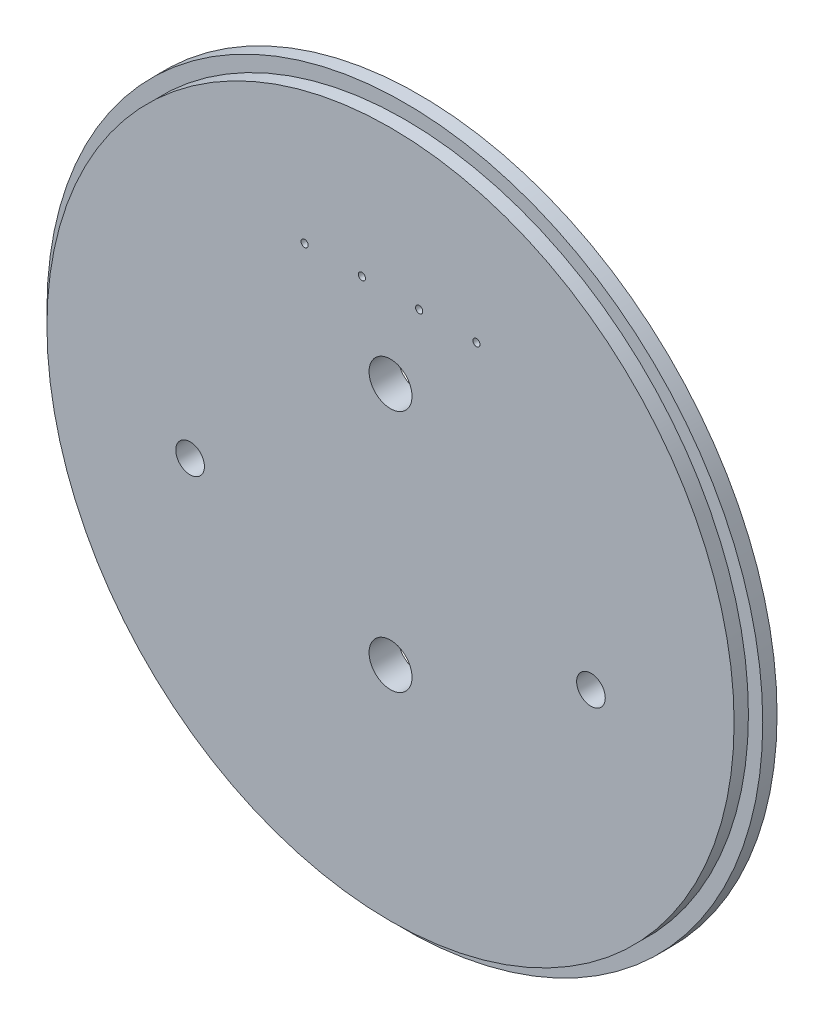
ISO-10303-21;
HEADER;
FILE_DESCRIPTION(('STEP AP214'),'2;1');
FILE_NAME('part.step','',(''),(''),'','','');
FILE_SCHEMA(('AUTOMOTIVE_DESIGN { 1 0 10303 214 1 1 1 1 }'));
ENDSEC;
DATA;
#1=APPLICATION_CONTEXT('core data for automotive mechanical design processes');
#2=APPLICATION_PROTOCOL_DEFINITION('international standard','automotive_design',2000,#1);
#3=PRODUCT_CONTEXT('',#1,'mechanical');
#4=PRODUCT('Part','Part','',(#3));
#5=PRODUCT_RELATED_PRODUCT_CATEGORY('part','',(#4));
#6=PRODUCT_DEFINITION_FORMATION('','',#4);
#7=PRODUCT_DEFINITION_CONTEXT('part definition',#1,'design');
#8=PRODUCT_DEFINITION('design','',#6,#7);
#9=PRODUCT_DEFINITION_SHAPE('','',#8);
#10=(LENGTH_UNIT() NAMED_UNIT(*) SI_UNIT(.MILLI.,.METRE.));
#11=(NAMED_UNIT(*) PLANE_ANGLE_UNIT() SI_UNIT($,.RADIAN.));
#12=(NAMED_UNIT(*) SI_UNIT($,.STERADIAN.) SOLID_ANGLE_UNIT());
#13=UNCERTAINTY_MEASURE_WITH_UNIT(LENGTH_MEASURE(1.E-05),#10,'distance_accuracy_value','');
#14=(GEOMETRIC_REPRESENTATION_CONTEXT(3) GLOBAL_UNCERTAINTY_ASSIGNED_CONTEXT((#13)) GLOBAL_UNIT_ASSIGNED_CONTEXT((#10,
#11,#12)) REPRESENTATION_CONTEXT('',''));
#15=CARTESIAN_POINT('',(0.,0.,0.));
#16=DIRECTION('',(0.,0.,1.));
#17=DIRECTION('',(1.,0.,0.));
#18=AXIS2_PLACEMENT_3D('',#15,#16,#17);
#19=CARTESIAN_POINT('',(0.,0.,3.175));
#20=DIRECTION('',(0.,0.,-1.));
#21=DIRECTION('',(-1.,0.,0.));
#22=AXIS2_PLACEMENT_3D('',#19,#20,#21);
#23=CYLINDRICAL_SURFACE('',#22,79.375);
#24=CARTESIAN_POINT('',(0.,0.,3.175));
#25=DIRECTION('',(0.,0.,1.));
#26=DIRECTION('',(1.,0.,0.));
#27=AXIS2_PLACEMENT_3D('',#24,#25,#26);
#28=CIRCLE('',#27,79.375);
#29=CARTESIAN_POINT('',(79.375,0.,3.175));
#30=VERTEX_POINT('',#29);
#31=EDGE_CURVE('E41',#30,#30,#28,.T.);
#32=ORIENTED_EDGE('',*,*,#31,.F.);
#33=EDGE_LOOP('',(#32));
#34=FACE_BOUND('',#33,.T.);
#35=CARTESIAN_POINT('',(0.,0.,0.));
#36=DIRECTION('',(0.,0.,1.));
#37=DIRECTION('',(1.,0.,0.));
#38=AXIS2_PLACEMENT_3D('',#35,#36,#37);
#39=CIRCLE('',#38,79.375);
#40=CARTESIAN_POINT('',(79.375,0.,0.));
#41=VERTEX_POINT('',#40);
#42=EDGE_CURVE('E37',#41,#41,#39,.T.);
#43=ORIENTED_EDGE('',*,*,#42,.T.);
#44=EDGE_LOOP('',(#43));
#45=FACE_BOUND('',#44,.T.);
#46=ADVANCED_FACE('F34',(#34,#45),#23,.T.);
#47=CARTESIAN_POINT('',(0.,0.,3.175));
#48=DIRECTION('',(0.,0.,1.));
#49=DIRECTION('',(1.,0.,0.));
#50=AXIS2_PLACEMENT_3D('',#47,#48,#49);
#51=PLANE('',#50);
#52=CARTESIAN_POINT('',(0.,0.,3.175));
#53=DIRECTION('',(0.,0.,1.));
#54=DIRECTION('',(1.,0.,0.));
#55=AXIS2_PLACEMENT_3D('',#52,#53,#54);
#56=CIRCLE('',#55,76.2);
#57=CARTESIAN_POINT('',(76.2,0.,3.175));
#58=VERTEX_POINT('',#57);
#59=EDGE_CURVE('E10',#58,#58,#56,.T.);
#60=ORIENTED_EDGE('',*,*,#59,.F.);
#61=EDGE_LOOP('',(#60));
#62=FACE_BOUND('',#61,.T.);
#63=ORIENTED_EDGE('',*,*,#31,.T.);
#64=EDGE_LOOP('',(#63));
#65=FACE_BOUND('',#64,.T.);
#66=ADVANCED_FACE('F131',(#62,#65),#51,.T.);
#67=CARTESIAN_POINT('',(0.,0.,0.));
#68=DIRECTION('',(0.,0.,1.));
#69=DIRECTION('',(1.,0.,0.));
#70=AXIS2_PLACEMENT_3D('',#67,#68,#69);
#71=PLANE('',#70);
#72=CARTESIAN_POINT('',(0.,-26.9875,0.));
#73=DIRECTION('',(0.,0.,1.));
#74=DIRECTION('',(1.,0.,0.));
#75=AXIS2_PLACEMENT_3D('',#72,#73,#74);
#76=CIRCLE('',#75,4.7625);
#77=CARTESIAN_POINT('',(4.7625,-26.9875,0.));
#78=VERTEX_POINT('',#77);
#79=EDGE_CURVE('E92',#78,#78,#76,.T.);
#80=ORIENTED_EDGE('',*,*,#79,.T.);
#81=EDGE_LOOP('',(#80));
#82=FACE_BOUND('',#81,.T.);
#83=CARTESIAN_POINT('',(0.,26.9875,0.));
#84=DIRECTION('',(0.,0.,1.));
#85=DIRECTION('',(1.,0.,0.));
#86=AXIS2_PLACEMENT_3D('',#83,#84,#85);
#87=CIRCLE('',#86,4.7625);
#88=CARTESIAN_POINT('',(4.76249999999999,26.9875,0.));
#89=VERTEX_POINT('',#88);
#90=EDGE_CURVE('E86',#89,#89,#87,.T.);
#91=ORIENTED_EDGE('',*,*,#90,.T.);
#92=EDGE_LOOP('',(#91));
#93=FACE_BOUND('',#92,.T.);
#94=CARTESIAN_POINT('',(-19.05,44.45,0.));
#95=DIRECTION('',(0.,0.,1.));
#96=DIRECTION('',(1.,0.,0.));
#97=AXIS2_PLACEMENT_3D('',#94,#95,#96);
#98=CIRCLE('',#97,0.793749999999916);
#99=CARTESIAN_POINT('',(-18.2562500000001,44.45,0.));
#100=VERTEX_POINT('',#99);
#101=EDGE_CURVE('E80',#100,#100,#98,.T.);
#102=ORIENTED_EDGE('',*,*,#101,.T.);
#103=EDGE_LOOP('',(#102));
#104=FACE_BOUND('',#103,.T.);
#105=CARTESIAN_POINT('',(-6.35,44.45,0.));
#106=DIRECTION('',(0.,0.,1.));
#107=DIRECTION('',(1.,0.,0.));
#108=AXIS2_PLACEMENT_3D('',#105,#106,#107);
#109=CIRCLE('',#108,0.793749999999915);
#110=CARTESIAN_POINT('',(-5.55625000000008,44.45,0.));
#111=VERTEX_POINT('',#110);
#112=EDGE_CURVE('E74',#111,#111,#109,.T.);
#113=ORIENTED_EDGE('',*,*,#112,.T.);
#114=EDGE_LOOP('',(#113));
#115=FACE_BOUND('',#114,.T.);
#116=CARTESIAN_POINT('',(6.35,44.45,0.));
#117=DIRECTION('',(0.,0.,1.));
#118=DIRECTION('',(1.,0.,0.));
#119=AXIS2_PLACEMENT_3D('',#116,#117,#118);
#120=CIRCLE('',#119,0.793749999999915);
#121=CARTESIAN_POINT('',(7.14374999999992,44.45,0.));
#122=VERTEX_POINT('',#121);
#123=EDGE_CURVE('E68',#122,#122,#120,.T.);
#124=ORIENTED_EDGE('',*,*,#123,.T.);
#125=EDGE_LOOP('',(#124));
#126=FACE_BOUND('',#125,.T.);
#127=CARTESIAN_POINT('',(19.05,44.45,0.));
#128=DIRECTION('',(0.,0.,1.));
#129=DIRECTION('',(1.,0.,0.));
#130=AXIS2_PLACEMENT_3D('',#127,#128,#129);
#131=CIRCLE('',#130,0.793749999999916);
#132=CARTESIAN_POINT('',(19.8437499999999,44.45,0.));
#133=VERTEX_POINT('',#132);
#134=EDGE_CURVE('E62',#133,#133,#131,.T.);
#135=ORIENTED_EDGE('',*,*,#134,.T.);
#136=EDGE_LOOP('',(#135));
#137=FACE_BOUND('',#136,.T.);
#138=CARTESIAN_POINT('',(-44.45,-9.525,0.));
#139=DIRECTION('',(0.,0.,1.));
#140=DIRECTION('',(1.,0.,0.));
#141=AXIS2_PLACEMENT_3D('',#138,#139,#140);
#142=CIRCLE('',#141,3.17499999999991);
#143=CARTESIAN_POINT('',(-41.2750000000001,-9.525,0.));
#144=VERTEX_POINT('',#143);
#145=EDGE_CURVE('E56',#144,#144,#142,.T.);
#146=ORIENTED_EDGE('',*,*,#145,.T.);
#147=EDGE_LOOP('',(#146));
#148=FACE_BOUND('',#147,.T.);
#149=CARTESIAN_POINT('',(44.45,-9.525,0.));
#150=DIRECTION('',(0.,0.,1.));
#151=DIRECTION('',(1.,0.,0.));
#152=AXIS2_PLACEMENT_3D('',#149,#150,#151);
#153=CIRCLE('',#152,3.17499999999991);
#154=CARTESIAN_POINT('',(47.6249999999999,-9.525,0.));
#155=VERTEX_POINT('',#154);
#156=EDGE_CURVE('E50',#155,#155,#153,.T.);
#157=ORIENTED_EDGE('',*,*,#156,.T.);
#158=EDGE_LOOP('',(#157));
#159=FACE_BOUND('',#158,.T.);
#160=ORIENTED_EDGE('',*,*,#42,.F.);
#161=EDGE_LOOP('',(#160));
#162=FACE_BOUND('',#161,.T.);
#163=ADVANCED_FACE('F124',(#82,#93,#104,#115,#126,#137,#148,#159,#162),#71,.F.);
#164=CARTESIAN_POINT('',(0.,0.,6.35));
#165=DIRECTION('',(0.,0.,-1.));
#166=DIRECTION('',(-1.,0.,0.));
#167=AXIS2_PLACEMENT_3D('',#164,#165,#166);
#168=CYLINDRICAL_SURFACE('',#167,76.2);
#169=CARTESIAN_POINT('',(0.,0.,6.35));
#170=DIRECTION('',(0.,0.,1.));
#171=DIRECTION('',(1.,0.,0.));
#172=AXIS2_PLACEMENT_3D('',#169,#170,#171);
#173=CIRCLE('',#172,76.2);
#174=CARTESIAN_POINT('',(76.2,0.,6.35));
#175=VERTEX_POINT('',#174);
#176=EDGE_CURVE('E47',#175,#175,#173,.T.);
#177=ORIENTED_EDGE('',*,*,#176,.F.);
#178=EDGE_LOOP('',(#177));
#179=FACE_BOUND('',#178,.T.);
#180=ORIENTED_EDGE('',*,*,#59,.T.);
#181=EDGE_LOOP('',(#180));
#182=FACE_BOUND('',#181,.T.);
#183=ADVANCED_FACE('F105',(#179,#182),#168,.T.);
#184=CARTESIAN_POINT('',(0.,0.,6.35));
#185=DIRECTION('',(0.,0.,1.));
#186=DIRECTION('',(1.,0.,0.));
#187=AXIS2_PLACEMENT_3D('',#184,#185,#186);
#188=PLANE('',#187);
#189=CARTESIAN_POINT('',(0.,-26.9875,6.35));
#190=DIRECTION('',(0.,0.,1.));
#191=DIRECTION('',(1.,0.,0.));
#192=AXIS2_PLACEMENT_3D('',#189,#190,#191);
#193=CIRCLE('',#192,4.7625);
#194=CARTESIAN_POINT('',(4.7625,-26.9875,6.35));
#195=VERTEX_POINT('',#194);
#196=EDGE_CURVE('E95',#195,#195,#193,.T.);
#197=ORIENTED_EDGE('',*,*,#196,.F.);
#198=EDGE_LOOP('',(#197));
#199=FACE_BOUND('',#198,.T.);
#200=CARTESIAN_POINT('',(0.,26.9875,6.35));
#201=DIRECTION('',(0.,0.,1.));
#202=DIRECTION('',(1.,0.,0.));
#203=AXIS2_PLACEMENT_3D('',#200,#201,#202);
#204=CIRCLE('',#203,4.7625);
#205=CARTESIAN_POINT('',(4.76249999999999,26.9875,6.35));
#206=VERTEX_POINT('',#205);
#207=EDGE_CURVE('E89',#206,#206,#204,.T.);
#208=ORIENTED_EDGE('',*,*,#207,.F.);
#209=EDGE_LOOP('',(#208));
#210=FACE_BOUND('',#209,.T.);
#211=CARTESIAN_POINT('',(-19.05,44.45,6.35));
#212=DIRECTION('',(0.,0.,1.));
#213=DIRECTION('',(1.,0.,0.));
#214=AXIS2_PLACEMENT_3D('',#211,#212,#213);
#215=CIRCLE('',#214,0.793749999999916);
#216=CARTESIAN_POINT('',(-18.2562500000001,44.45,6.35));
#217=VERTEX_POINT('',#216);
#218=EDGE_CURVE('E83',#217,#217,#215,.T.);
#219=ORIENTED_EDGE('',*,*,#218,.F.);
#220=EDGE_LOOP('',(#219));
#221=FACE_BOUND('',#220,.T.);
#222=CARTESIAN_POINT('',(-6.35,44.45,6.35));
#223=DIRECTION('',(0.,0.,1.));
#224=DIRECTION('',(1.,0.,0.));
#225=AXIS2_PLACEMENT_3D('',#222,#223,#224);
#226=CIRCLE('',#225,0.793749999999916);
#227=CARTESIAN_POINT('',(-5.55625000000008,44.45,6.35));
#228=VERTEX_POINT('',#227);
#229=EDGE_CURVE('E77',#228,#228,#226,.T.);
#230=ORIENTED_EDGE('',*,*,#229,.F.);
#231=EDGE_LOOP('',(#230));
#232=FACE_BOUND('',#231,.T.);
#233=CARTESIAN_POINT('',(6.35,44.45,6.35));
#234=DIRECTION('',(0.,0.,1.));
#235=DIRECTION('',(1.,0.,0.));
#236=AXIS2_PLACEMENT_3D('',#233,#234,#235);
#237=CIRCLE('',#236,0.793749999999916);
#238=CARTESIAN_POINT('',(7.14374999999992,44.45,6.35));
#239=VERTEX_POINT('',#238);
#240=EDGE_CURVE('E71',#239,#239,#237,.T.);
#241=ORIENTED_EDGE('',*,*,#240,.F.);
#242=EDGE_LOOP('',(#241));
#243=FACE_BOUND('',#242,.T.);
#244=CARTESIAN_POINT('',(19.05,44.45,6.35));
#245=DIRECTION('',(0.,0.,1.));
#246=DIRECTION('',(1.,0.,0.));
#247=AXIS2_PLACEMENT_3D('',#244,#245,#246);
#248=CIRCLE('',#247,0.793749999999916);
#249=CARTESIAN_POINT('',(19.8437499999999,44.45,6.35));
#250=VERTEX_POINT('',#249);
#251=EDGE_CURVE('E65',#250,#250,#248,.T.);
#252=ORIENTED_EDGE('',*,*,#251,.F.);
#253=EDGE_LOOP('',(#252));
#254=FACE_BOUND('',#253,.T.);
#255=CARTESIAN_POINT('',(-44.45,-9.525,6.35));
#256=DIRECTION('',(0.,0.,1.));
#257=DIRECTION('',(1.,0.,0.));
#258=AXIS2_PLACEMENT_3D('',#255,#256,#257);
#259=CIRCLE('',#258,3.17499999999999);
#260=CARTESIAN_POINT('',(-41.275,-9.525,6.35));
#261=VERTEX_POINT('',#260);
#262=EDGE_CURVE('E59',#261,#261,#259,.T.);
#263=ORIENTED_EDGE('',*,*,#262,.F.);
#264=EDGE_LOOP('',(#263));
#265=FACE_BOUND('',#264,.T.);
#266=CARTESIAN_POINT('',(44.45,-9.525,6.35));
#267=DIRECTION('',(0.,0.,1.));
#268=DIRECTION('',(1.,0.,0.));
#269=AXIS2_PLACEMENT_3D('',#266,#267,#268);
#270=CIRCLE('',#269,3.17499999999999);
#271=CARTESIAN_POINT('',(47.625,-9.525,6.35));
#272=VERTEX_POINT('',#271);
#273=EDGE_CURVE('E53',#272,#272,#270,.T.);
#274=ORIENTED_EDGE('',*,*,#273,.F.);
#275=EDGE_LOOP('',(#274));
#276=FACE_BOUND('',#275,.T.);
#277=ORIENTED_EDGE('',*,*,#176,.T.);
#278=EDGE_LOOP('',(#277));
#279=FACE_BOUND('',#278,.T.);
#280=ADVANCED_FACE('F101',(#199,#210,#221,#232,#243,#254,#265,#276,#279),#188,.T.);
#281=CARTESIAN_POINT('',(44.45,-9.525,6.35));
#282=DIRECTION('',(0.,0.,1.));
#283=DIRECTION('',(1.,0.,0.));
#284=AXIS2_PLACEMENT_3D('',#281,#282,#283);
#285=CYLINDRICAL_SURFACE('',#284,3.17499999999995);
#286=ORIENTED_EDGE('',*,*,#156,.F.);
#287=EDGE_LOOP('',(#286));
#288=FACE_BOUND('',#287,.T.);
#289=ORIENTED_EDGE('',*,*,#273,.T.);
#290=EDGE_LOOP('',(#289));
#291=FACE_BOUND('',#290,.T.);
#292=ADVANCED_FACE('F104',(#288,#291),#285,.F.);
#293=CARTESIAN_POINT('',(-44.45,-9.525,6.35));
#294=DIRECTION('',(0.,0.,1.));
#295=DIRECTION('',(1.,0.,0.));
#296=AXIS2_PLACEMENT_3D('',#293,#294,#295);
#297=CYLINDRICAL_SURFACE('',#296,3.17499999999995);
#298=ORIENTED_EDGE('',*,*,#145,.F.);
#299=EDGE_LOOP('',(#298));
#300=FACE_BOUND('',#299,.T.);
#301=ORIENTED_EDGE('',*,*,#262,.T.);
#302=EDGE_LOOP('',(#301));
#303=FACE_BOUND('',#302,.T.);
#304=ADVANCED_FACE('F221',(#300,#303),#297,.F.);
#305=CARTESIAN_POINT('',(19.05,44.45,6.35));
#306=DIRECTION('',(0.,0.,1.));
#307=DIRECTION('',(1.,0.,0.));
#308=AXIS2_PLACEMENT_3D('',#305,#306,#307);
#309=CYLINDRICAL_SURFACE('',#308,0.793749999999916);
#310=ORIENTED_EDGE('',*,*,#134,.F.);
#311=EDGE_LOOP('',(#310));
#312=FACE_BOUND('',#311,.T.);
#313=ORIENTED_EDGE('',*,*,#251,.T.);
#314=EDGE_LOOP('',(#313));
#315=FACE_BOUND('',#314,.T.);
#316=ADVANCED_FACE('F211',(#312,#315),#309,.F.);
#317=CARTESIAN_POINT('',(6.35,44.45,6.35));
#318=DIRECTION('',(0.,0.,1.));
#319=DIRECTION('',(1.,0.,0.));
#320=AXIS2_PLACEMENT_3D('',#317,#318,#319);
#321=CYLINDRICAL_SURFACE('',#320,0.793749999999916);
#322=ORIENTED_EDGE('',*,*,#123,.F.);
#323=EDGE_LOOP('',(#322));
#324=FACE_BOUND('',#323,.T.);
#325=ORIENTED_EDGE('',*,*,#240,.T.);
#326=EDGE_LOOP('',(#325));
#327=FACE_BOUND('',#326,.T.);
#328=ADVANCED_FACE('F202',(#324,#327),#321,.F.);
#329=CARTESIAN_POINT('',(-6.35,44.45,6.35));
#330=DIRECTION('',(0.,0.,1.));
#331=DIRECTION('',(1.,0.,0.));
#332=AXIS2_PLACEMENT_3D('',#329,#330,#331);
#333=CYLINDRICAL_SURFACE('',#332,0.793749999999916);
#334=ORIENTED_EDGE('',*,*,#112,.F.);
#335=EDGE_LOOP('',(#334));
#336=FACE_BOUND('',#335,.T.);
#337=ORIENTED_EDGE('',*,*,#229,.T.);
#338=EDGE_LOOP('',(#337));
#339=FACE_BOUND('',#338,.T.);
#340=ADVANCED_FACE('F193',(#336,#339),#333,.F.);
#341=CARTESIAN_POINT('',(-19.05,44.45,6.35));
#342=DIRECTION('',(0.,0.,1.));
#343=DIRECTION('',(1.,0.,0.));
#344=AXIS2_PLACEMENT_3D('',#341,#342,#343);
#345=CYLINDRICAL_SURFACE('',#344,0.793749999999916);
#346=ORIENTED_EDGE('',*,*,#101,.F.);
#347=EDGE_LOOP('',(#346));
#348=FACE_BOUND('',#347,.T.);
#349=ORIENTED_EDGE('',*,*,#218,.T.);
#350=EDGE_LOOP('',(#349));
#351=FACE_BOUND('',#350,.T.);
#352=ADVANCED_FACE('F158',(#348,#351),#345,.F.);
#353=CARTESIAN_POINT('',(0.,26.9875,6.35));
#354=DIRECTION('',(0.,0.,1.));
#355=DIRECTION('',(1.,0.,0.));
#356=AXIS2_PLACEMENT_3D('',#353,#354,#355);
#357=CYLINDRICAL_SURFACE('',#356,4.7625);
#358=ORIENTED_EDGE('',*,*,#90,.F.);
#359=EDGE_LOOP('',(#358));
#360=FACE_BOUND('',#359,.T.);
#361=ORIENTED_EDGE('',*,*,#207,.T.);
#362=EDGE_LOOP('',(#361));
#363=FACE_BOUND('',#362,.T.);
#364=ADVANCED_FACE('F168',(#360,#363),#357,.F.);
#365=CARTESIAN_POINT('',(0.,-26.9875,6.35));
#366=DIRECTION('',(0.,0.,1.));
#367=DIRECTION('',(1.,0.,0.));
#368=AXIS2_PLACEMENT_3D('',#365,#366,#367);
#369=CYLINDRICAL_SURFACE('',#368,4.7625);
#370=ORIENTED_EDGE('',*,*,#79,.F.);
#371=EDGE_LOOP('',(#370));
#372=FACE_BOUND('',#371,.T.);
#373=ORIENTED_EDGE('',*,*,#196,.T.);
#374=EDGE_LOOP('',(#373));
#375=FACE_BOUND('',#374,.T.);
#376=ADVANCED_FACE('F99',(#372,#375),#369,.F.);
#377=CLOSED_SHELL('',(#46,#66,#163,#183,#280,#292,#304,#316,#328,#340,#352,#364,#376));
#378=MANIFOLD_SOLID_BREP('B2',#377);
#379=ADVANCED_BREP_SHAPE_REPRESENTATION('',(#18,#378),#14);
#380=SHAPE_DEFINITION_REPRESENTATION(#9,#379);
ENDSEC;
END-ISO-10303-21;
